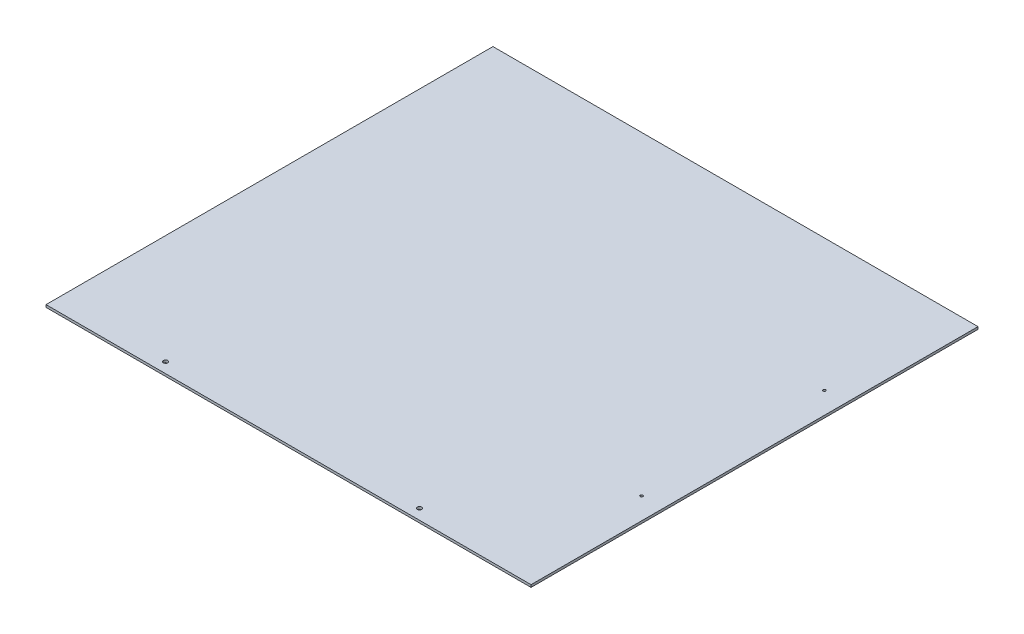
ISO-10303-21;
HEADER;
FILE_DESCRIPTION(('STEP AP214'),'2;1');
FILE_NAME('part.step','',(''),(''),'','','');
FILE_SCHEMA(('AUTOMOTIVE_DESIGN { 1 0 10303 214 1 1 1 1 }'));
ENDSEC;
DATA;
#1=APPLICATION_CONTEXT('core data for automotive mechanical design processes');
#2=APPLICATION_PROTOCOL_DEFINITION('international standard','automotive_design',2000,#1);
#3=PRODUCT_CONTEXT('',#1,'mechanical');
#4=PRODUCT('Part','Part','',(#3));
#5=PRODUCT_RELATED_PRODUCT_CATEGORY('part','',(#4));
#6=PRODUCT_DEFINITION_FORMATION('','',#4);
#7=PRODUCT_DEFINITION_CONTEXT('part definition',#1,'design');
#8=PRODUCT_DEFINITION('design','',#6,#7);
#9=PRODUCT_DEFINITION_SHAPE('','',#8);
#10=(LENGTH_UNIT() NAMED_UNIT(*) SI_UNIT(.MILLI.,.METRE.));
#11=(NAMED_UNIT(*) PLANE_ANGLE_UNIT() SI_UNIT($,.RADIAN.));
#12=(NAMED_UNIT(*) SI_UNIT($,.STERADIAN.) SOLID_ANGLE_UNIT());
#13=UNCERTAINTY_MEASURE_WITH_UNIT(LENGTH_MEASURE(1.E-05),#10,'distance_accuracy_value','');
#14=(GEOMETRIC_REPRESENTATION_CONTEXT(3) GLOBAL_UNCERTAINTY_ASSIGNED_CONTEXT((#13)) GLOBAL_UNIT_ASSIGNED_CONTEXT((#10,
#11,#12)) REPRESENTATION_CONTEXT('',''));
#15=CARTESIAN_POINT('',(0.,0.,0.));
#16=DIRECTION('',(0.,0.,1.));
#17=DIRECTION('',(1.,0.,0.));
#18=AXIS2_PLACEMENT_3D('',#15,#16,#17);
#19=CARTESIAN_POINT('',(-303.2125,0.,-279.4));
#20=DIRECTION('',(0.,0.,1.));
#21=DIRECTION('',(1.,0.,0.));
#22=AXIS2_PLACEMENT_3D('',#19,#20,#21);
#23=PLANE('',#22);
#24=DIRECTION('',(0.,-1.,0.));
#25=VECTOR('',#24,1.);
#26=CARTESIAN_POINT('',(303.2125,1.5,-279.4));
#27=LINE('',#26,#25);
#28=CARTESIAN_POINT('',(303.2125,3.,-279.4));
#29=VERTEX_POINT('',#28);
#30=CARTESIAN_POINT('',(303.2125,0.,-279.4));
#31=VERTEX_POINT('',#30);
#32=EDGE_CURVE('E55',#29,#31,#27,.T.);
#33=ORIENTED_EDGE('',*,*,#32,.T.);
#34=DIRECTION('',(-1.,0.,0.));
#35=VECTOR('',#34,1.);
#36=CARTESIAN_POINT('',(0.,0.,-279.4));
#37=LINE('',#36,#35);
#38=CARTESIAN_POINT('',(-303.2125,0.,-279.4));
#39=VERTEX_POINT('',#38);
#40=EDGE_CURVE('E71',#31,#39,#37,.T.);
#41=ORIENTED_EDGE('',*,*,#40,.T.);
#42=DIRECTION('',(0.,1.,0.));
#43=VECTOR('',#42,1.);
#44=CARTESIAN_POINT('',(-303.2125,1.5,-279.4));
#45=LINE('',#44,#43);
#46=CARTESIAN_POINT('',(-303.2125,3.,-279.4));
#47=VERTEX_POINT('',#46);
#48=EDGE_CURVE('E70',#39,#47,#45,.T.);
#49=ORIENTED_EDGE('',*,*,#48,.T.);
#50=DIRECTION('',(-1.,0.,0.));
#51=VECTOR('',#50,1.);
#52=CARTESIAN_POINT('',(0.,3.,-279.4));
#53=LINE('',#52,#51);
#54=EDGE_CURVE('E60',#29,#47,#53,.T.);
#55=ORIENTED_EDGE('',*,*,#54,.F.);
#56=EDGE_LOOP('',(#33,#41,#49,#55));
#57=FACE_BOUND('',#56,.T.);
#58=ADVANCED_FACE('F17',(#57),#23,.F.);
#59=CARTESIAN_POINT('',(-303.2125,0.,279.4));
#60=DIRECTION('',(1.,0.,0.));
#61=DIRECTION('',(0.,0.,-1.));
#62=AXIS2_PLACEMENT_3D('',#59,#60,#61);
#63=PLANE('',#62);
#64=ORIENTED_EDGE('',*,*,#48,.F.);
#65=DIRECTION('',(0.,0.,1.));
#66=VECTOR('',#65,1.);
#67=CARTESIAN_POINT('',(-303.2125,0.,0.));
#68=LINE('',#67,#66);
#69=CARTESIAN_POINT('',(-303.2125,0.,279.4));
#70=VERTEX_POINT('',#69);
#71=EDGE_CURVE('E110',#39,#70,#68,.T.);
#72=ORIENTED_EDGE('',*,*,#71,.T.);
#73=DIRECTION('',(0.,1.,0.));
#74=VECTOR('',#73,1.);
#75=CARTESIAN_POINT('',(-303.2125,1.5,279.4));
#76=LINE('',#75,#74);
#77=CARTESIAN_POINT('',(-303.2125,3.,279.4));
#78=VERTEX_POINT('',#77);
#79=EDGE_CURVE('E75',#70,#78,#76,.T.);
#80=ORIENTED_EDGE('',*,*,#79,.T.);
#81=DIRECTION('',(0.,0.,1.));
#82=VECTOR('',#81,1.);
#83=CARTESIAN_POINT('',(-303.2125,3.,0.));
#84=LINE('',#83,#82);
#85=EDGE_CURVE('E64',#47,#78,#84,.T.);
#86=ORIENTED_EDGE('',*,*,#85,.F.);
#87=EDGE_LOOP('',(#64,#72,#80,#86));
#88=FACE_BOUND('',#87,.T.);
#89=ADVANCED_FACE('F77',(#88),#63,.F.);
#90=CARTESIAN_POINT('',(303.2125,0.,279.4));
#91=DIRECTION('',(0.,0.,-1.));
#92=DIRECTION('',(-1.,0.,0.));
#93=AXIS2_PLACEMENT_3D('',#90,#91,#92);
#94=PLANE('',#93);
#95=ORIENTED_EDGE('',*,*,#79,.F.);
#96=DIRECTION('',(1.,0.,0.));
#97=VECTOR('',#96,1.);
#98=CARTESIAN_POINT('',(0.,0.,279.4));
#99=LINE('',#98,#97);
#100=CARTESIAN_POINT('',(303.2125,0.,279.4));
#101=VERTEX_POINT('',#100);
#102=EDGE_CURVE('E112',#70,#101,#99,.T.);
#103=ORIENTED_EDGE('',*,*,#102,.T.);
#104=DIRECTION('',(0.,1.,0.));
#105=VECTOR('',#104,1.);
#106=CARTESIAN_POINT('',(303.2125,1.5,279.4));
#107=LINE('',#106,#105);
#108=CARTESIAN_POINT('',(303.2125,3.,279.4));
#109=VERTEX_POINT('',#108);
#110=EDGE_CURVE('E36',#101,#109,#107,.T.);
#111=ORIENTED_EDGE('',*,*,#110,.T.);
#112=DIRECTION('',(1.,0.,0.));
#113=VECTOR('',#112,1.);
#114=CARTESIAN_POINT('',(0.,3.,279.4));
#115=LINE('',#114,#113);
#116=EDGE_CURVE('E79',#78,#109,#115,.T.);
#117=ORIENTED_EDGE('',*,*,#116,.F.);
#118=EDGE_LOOP('',(#95,#103,#111,#117));
#119=FACE_BOUND('',#118,.T.);
#120=ADVANCED_FACE('F119',(#119),#94,.F.);
#121=CARTESIAN_POINT('',(303.2125,0.,-279.4));
#122=DIRECTION('',(-1.,0.,0.));
#123=DIRECTION('',(0.,0.,1.));
#124=AXIS2_PLACEMENT_3D('',#121,#122,#123);
#125=PLANE('',#124);
#126=ORIENTED_EDGE('',*,*,#110,.F.);
#127=DIRECTION('',(0.,0.,-1.));
#128=VECTOR('',#127,1.);
#129=CARTESIAN_POINT('',(303.2125,0.,0.));
#130=LINE('',#129,#128);
#131=EDGE_CURVE('E98',#101,#31,#130,.T.);
#132=ORIENTED_EDGE('',*,*,#131,.T.);
#133=ORIENTED_EDGE('',*,*,#32,.F.);
#134=DIRECTION('',(0.,0.,-1.));
#135=VECTOR('',#134,1.);
#136=CARTESIAN_POINT('',(303.2125,3.,0.));
#137=LINE('',#136,#135);
#138=EDGE_CURVE('E66',#109,#29,#137,.T.);
#139=ORIENTED_EDGE('',*,*,#138,.F.);
#140=EDGE_LOOP('',(#126,#132,#133,#139));
#141=FACE_BOUND('',#140,.T.);
#142=ADVANCED_FACE('F115',(#141),#125,.F.);
#143=CARTESIAN_POINT('',(276.2265,3.,114.3));
#144=DIRECTION('',(0.,-1.,0.));
#145=DIRECTION('',(0.,0.,-1.));
#146=AXIS2_PLACEMENT_3D('',#143,#144,#145);
#147=CYLINDRICAL_SURFACE('',#146,1.6256);
#148=CARTESIAN_POINT('',(276.2265,0.,114.3));
#149=DIRECTION('',(0.,-1.,0.));
#150=DIRECTION('',(0.,0.,-1.));
#151=AXIS2_PLACEMENT_3D('',#148,#149,#150);
#152=CIRCLE('',#151,1.6256);
#153=CARTESIAN_POINT('',(276.2265,0.,112.6744));
#154=VERTEX_POINT('',#153);
#155=EDGE_CURVE('E95',#154,#154,#152,.T.);
#156=ORIENTED_EDGE('',*,*,#155,.T.);
#157=EDGE_LOOP('',(#156));
#158=FACE_BOUND('',#157,.T.);
#159=CARTESIAN_POINT('',(276.2265,3.,114.3));
#160=DIRECTION('',(0.,-1.,0.));
#161=DIRECTION('',(0.,0.,-1.));
#162=AXIS2_PLACEMENT_3D('',#159,#160,#161);
#163=CIRCLE('',#162,1.6256);
#164=CARTESIAN_POINT('',(276.2265,3.,112.6744));
#165=VERTEX_POINT('',#164);
#166=EDGE_CURVE('E21',#165,#165,#163,.T.);
#167=ORIENTED_EDGE('',*,*,#166,.F.);
#168=EDGE_LOOP('',(#167));
#169=FACE_BOUND('',#168,.T.);
#170=ADVANCED_FACE('F127',(#158,#169),#147,.F.);
#171=CARTESIAN_POINT('',(-166.6875,3.,266.446));
#172=DIRECTION('',(0.,-1.,0.));
#173=DIRECTION('',(0.,0.,-1.));
#174=AXIS2_PLACEMENT_3D('',#171,#172,#173);
#175=CYLINDRICAL_SURFACE('',#174,2.66699999999997);
#176=CARTESIAN_POINT('',(-166.6875,0.,266.446));
#177=DIRECTION('',(0.,-1.,0.));
#178=DIRECTION('',(0.,0.,-1.));
#179=AXIS2_PLACEMENT_3D('',#176,#177,#178);
#180=CIRCLE('',#179,2.66699999999997);
#181=CARTESIAN_POINT('',(-166.6875,0.,263.779));
#182=VERTEX_POINT('',#181);
#183=EDGE_CURVE('E92',#182,#182,#180,.T.);
#184=ORIENTED_EDGE('',*,*,#183,.T.);
#185=EDGE_LOOP('',(#184));
#186=FACE_BOUND('',#185,.T.);
#187=CARTESIAN_POINT('',(-166.6875,3.,266.446));
#188=DIRECTION('',(0.,-1.,0.));
#189=DIRECTION('',(0.,0.,-1.));
#190=AXIS2_PLACEMENT_3D('',#187,#188,#189);
#191=CIRCLE('',#190,2.66699999999997);
#192=CARTESIAN_POINT('',(-166.6875,3.,263.779));
#193=VERTEX_POINT('',#192);
#194=EDGE_CURVE('E101',#193,#193,#191,.T.);
#195=ORIENTED_EDGE('',*,*,#194,.F.);
#196=EDGE_LOOP('',(#195));
#197=FACE_BOUND('',#196,.T.);
#198=ADVANCED_FACE('F143',(#186,#197),#175,.F.);
#199=CARTESIAN_POINT('',(150.8125,3.,266.446));
#200=DIRECTION('',(0.,-1.,0.));
#201=DIRECTION('',(0.,0.,-1.));
#202=AXIS2_PLACEMENT_3D('',#199,#200,#201);
#203=CYLINDRICAL_SURFACE('',#202,2.66699999999997);
#204=CARTESIAN_POINT('',(150.8125,0.,266.446));
#205=DIRECTION('',(0.,-1.,0.));
#206=DIRECTION('',(0.,0.,-1.));
#207=AXIS2_PLACEMENT_3D('',#204,#205,#206);
#208=CIRCLE('',#207,2.66699999999997);
#209=CARTESIAN_POINT('',(150.8125,0.,263.779));
#210=VERTEX_POINT('',#209);
#211=EDGE_CURVE('E89',#210,#210,#208,.T.);
#212=ORIENTED_EDGE('',*,*,#211,.T.);
#213=EDGE_LOOP('',(#212));
#214=FACE_BOUND('',#213,.T.);
#215=CARTESIAN_POINT('',(150.8125,3.,266.446));
#216=DIRECTION('',(0.,-1.,0.));
#217=DIRECTION('',(0.,0.,-1.));
#218=AXIS2_PLACEMENT_3D('',#215,#216,#217);
#219=CIRCLE('',#218,2.66699999999997);
#220=CARTESIAN_POINT('',(150.8125,3.,263.779));
#221=VERTEX_POINT('',#220);
#222=EDGE_CURVE('E99',#221,#221,#219,.T.);
#223=ORIENTED_EDGE('',*,*,#222,.F.);
#224=EDGE_LOOP('',(#223));
#225=FACE_BOUND('',#224,.T.);
#226=ADVANCED_FACE('F140',(#214,#225),#203,.F.);
#227=CARTESIAN_POINT('',(-303.2125,3.,-279.4));
#228=DIRECTION('',(0.,1.,0.));
#229=DIRECTION('',(0.,0.,1.));
#230=AXIS2_PLACEMENT_3D('',#227,#228,#229);
#231=PLANE('',#230);
#232=ORIENTED_EDGE('',*,*,#222,.T.);
#233=EDGE_LOOP('',(#232));
#234=FACE_BOUND('',#233,.T.);
#235=ORIENTED_EDGE('',*,*,#194,.T.);
#236=EDGE_LOOP('',(#235));
#237=FACE_BOUND('',#236,.T.);
#238=ORIENTED_EDGE('',*,*,#166,.T.);
#239=EDGE_LOOP('',(#238));
#240=FACE_BOUND('',#239,.T.);
#241=CARTESIAN_POINT('',(276.2265,3.,-114.3));
#242=DIRECTION('',(0.,-1.,0.));
#243=DIRECTION('',(0.,0.,-1.));
#244=AXIS2_PLACEMENT_3D('',#241,#242,#243);
#245=CIRCLE('',#244,1.6256);
#246=CARTESIAN_POINT('',(276.2265,3.,-115.9256));
#247=VERTEX_POINT('',#246);
#248=EDGE_CURVE('E27',#247,#247,#245,.F.);
#249=ORIENTED_EDGE('',*,*,#248,.F.);
#250=EDGE_LOOP('',(#249));
#251=FACE_BOUND('',#250,.T.);
#252=ORIENTED_EDGE('',*,*,#116,.T.);
#253=ORIENTED_EDGE('',*,*,#138,.T.);
#254=ORIENTED_EDGE('',*,*,#54,.T.);
#255=ORIENTED_EDGE('',*,*,#85,.T.);
#256=EDGE_LOOP('',(#252,#253,#254,#255));
#257=FACE_BOUND('',#256,.T.);
#258=ADVANCED_FACE('F62',(#234,#237,#240,#251,#257),#231,.T.);
#259=CARTESIAN_POINT('',(-303.2125,0.,-279.4));
#260=DIRECTION('',(0.,1.,0.));
#261=DIRECTION('',(0.,0.,1.));
#262=AXIS2_PLACEMENT_3D('',#259,#260,#261);
#263=PLANE('',#262);
#264=ORIENTED_EDGE('',*,*,#211,.F.);
#265=EDGE_LOOP('',(#264));
#266=FACE_BOUND('',#265,.T.);
#267=ORIENTED_EDGE('',*,*,#183,.F.);
#268=EDGE_LOOP('',(#267));
#269=FACE_BOUND('',#268,.T.);
#270=ORIENTED_EDGE('',*,*,#155,.F.);
#271=EDGE_LOOP('',(#270));
#272=FACE_BOUND('',#271,.T.);
#273=CARTESIAN_POINT('',(276.2265,0.,-114.3));
#274=DIRECTION('',(0.,-1.,0.));
#275=DIRECTION('',(0.,0.,-1.));
#276=AXIS2_PLACEMENT_3D('',#273,#274,#275);
#277=CIRCLE('',#276,1.6256);
#278=CARTESIAN_POINT('',(276.2265,0.,-115.9256));
#279=VERTEX_POINT('',#278);
#280=EDGE_CURVE('E11',#279,#279,#277,.T.);
#281=ORIENTED_EDGE('',*,*,#280,.F.);
#282=EDGE_LOOP('',(#281));
#283=FACE_BOUND('',#282,.T.);
#284=ORIENTED_EDGE('',*,*,#102,.F.);
#285=ORIENTED_EDGE('',*,*,#71,.F.);
#286=ORIENTED_EDGE('',*,*,#40,.F.);
#287=ORIENTED_EDGE('',*,*,#131,.F.);
#288=EDGE_LOOP('',(#284,#285,#286,#287));
#289=FACE_BOUND('',#288,.T.);
#290=ADVANCED_FACE('F19',(#266,#269,#272,#283,#289),#263,.F.);
#291=CARTESIAN_POINT('',(276.2265,3.,-114.3));
#292=DIRECTION('',(0.,-1.,0.));
#293=DIRECTION('',(0.,0.,-1.));
#294=AXIS2_PLACEMENT_3D('',#291,#292,#293);
#295=CYLINDRICAL_SURFACE('',#294,1.6256);
#296=ORIENTED_EDGE('',*,*,#280,.T.);
#297=EDGE_LOOP('',(#296));
#298=FACE_BOUND('',#297,.T.);
#299=ORIENTED_EDGE('',*,*,#248,.T.);
#300=EDGE_LOOP('',(#299));
#301=FACE_BOUND('',#300,.T.);
#302=ADVANCED_FACE('F130',(#298,#301),#295,.F.);
#303=CLOSED_SHELL('',(#58,#89,#120,#142,#170,#198,#226,#258,#290,#302));
#304=MANIFOLD_SOLID_BREP('B1',#303);
#305=ADVANCED_BREP_SHAPE_REPRESENTATION('',(#18,#304),#14);
#306=SHAPE_DEFINITION_REPRESENTATION(#9,#305);
ENDSEC;
END-ISO-10303-21;
